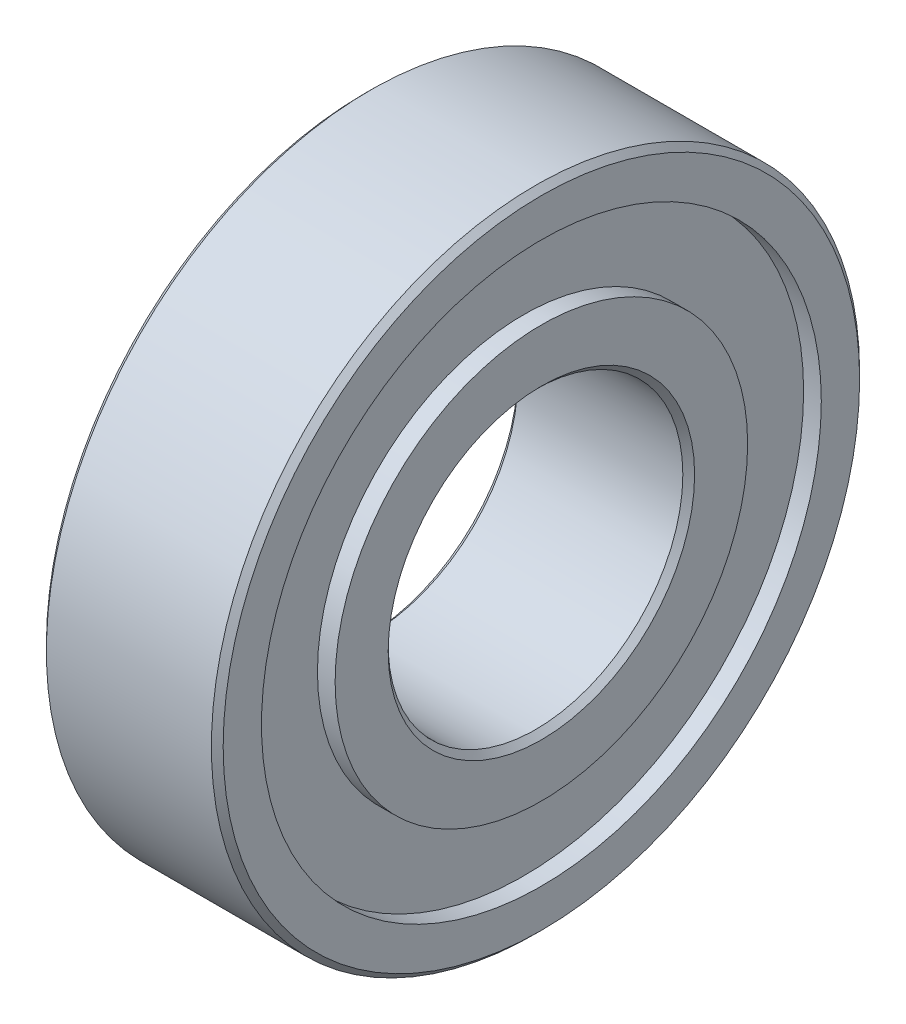
ISO-10303-21;
HEADER;
FILE_DESCRIPTION(('STEP AP214'),'2;1');
FILE_NAME('part.step','',(''),(''),'','','');
FILE_SCHEMA(('AUTOMOTIVE_DESIGN { 1 0 10303 214 1 1 1 1 }'));
ENDSEC;
DATA;
#1=APPLICATION_CONTEXT('core data for automotive mechanical design processes');
#2=APPLICATION_PROTOCOL_DEFINITION('international standard','automotive_design',2000,#1);
#3=PRODUCT_CONTEXT('',#1,'mechanical');
#4=PRODUCT('Part','Part','',(#3));
#5=PRODUCT_RELATED_PRODUCT_CATEGORY('part','',(#4));
#6=PRODUCT_DEFINITION_FORMATION('','',#4);
#7=PRODUCT_DEFINITION_CONTEXT('part definition',#1,'design');
#8=PRODUCT_DEFINITION('design','',#6,#7);
#9=PRODUCT_DEFINITION_SHAPE('','',#8);
#10=(LENGTH_UNIT() NAMED_UNIT(*) SI_UNIT(.MILLI.,.METRE.));
#11=(NAMED_UNIT(*) PLANE_ANGLE_UNIT() SI_UNIT($,.RADIAN.));
#12=(NAMED_UNIT(*) SI_UNIT($,.STERADIAN.) SOLID_ANGLE_UNIT());
#13=UNCERTAINTY_MEASURE_WITH_UNIT(LENGTH_MEASURE(1.E-05),#10,'distance_accuracy_value','');
#14=(GEOMETRIC_REPRESENTATION_CONTEXT(3) GLOBAL_UNCERTAINTY_ASSIGNED_CONTEXT((#13)) GLOBAL_UNIT_ASSIGNED_CONTEXT((#10,
#11,#12)) REPRESENTATION_CONTEXT('',''));
#15=CARTESIAN_POINT('',(0.,0.,0.));
#16=DIRECTION('',(0.,0.,1.));
#17=DIRECTION('',(1.,0.,0.));
#18=AXIS2_PLACEMENT_3D('',#15,#16,#17);
#19=CARTESIAN_POINT('',(0.,0.,0.));
#20=DIRECTION('',(1.,0.,0.));
#21=DIRECTION('',(0.,0.,-1.));
#22=AXIS2_PLACEMENT_3D('',#19,#20,#21);
#23=PLANE('',#22);
#24=CARTESIAN_POINT('',(0.,0.,0.));
#25=DIRECTION('',(1.,0.,0.));
#26=DIRECTION('',(0.,0.,-1.));
#27=AXIS2_PLACEMENT_3D('',#24,#25,#26);
#28=CIRCLE('',#27,5.2);
#29=CARTESIAN_POINT('',(0.,0.,-5.2));
#30=VERTEX_POINT('',#29);
#31=EDGE_CURVE('E10',#30,#30,#28,.T.);
#32=ORIENTED_EDGE('',*,*,#31,.T.);
#33=EDGE_LOOP('',(#32));
#34=FACE_BOUND('',#33,.T.);
#35=CARTESIAN_POINT('',(0.,0.,0.45087681169876));
#36=DIRECTION('',(-1.,0.,0.));
#37=DIRECTION('',(0.,0.,1.));
#38=AXIS2_PLACEMENT_3D('',#35,#36,#37);
#39=CIRCLE('',#38,7.);
#40=CARTESIAN_POINT('',(0.,0.,7.45087681169876));
#41=VERTEX_POINT('',#40);
#42=EDGE_CURVE('E83',#41,#41,#39,.T.);
#43=ORIENTED_EDGE('',*,*,#42,.T.);
#44=EDGE_LOOP('',(#43));
#45=FACE_BOUND('',#44,.T.);
#46=ADVANCED_FACE('F32',(#34,#45),#23,.F.);
#47=CARTESIAN_POINT('',(6.,0.,0.));
#48=DIRECTION('',(1.,0.,0.));
#49=DIRECTION('',(0.,0.,-1.));
#50=AXIS2_PLACEMENT_3D('',#47,#48,#49);
#51=PLANE('',#50);
#52=CARTESIAN_POINT('',(6.,0.,0.));
#53=DIRECTION('',(1.,0.,0.));
#54=DIRECTION('',(0.,0.,-1.));
#55=AXIS2_PLACEMENT_3D('',#52,#53,#54);
#56=CIRCLE('',#55,5.20000000000001);
#57=CARTESIAN_POINT('',(6.,0.,-5.20000000000001));
#58=VERTEX_POINT('',#57);
#59=EDGE_CURVE('E39',#58,#58,#56,.F.);
#60=ORIENTED_EDGE('',*,*,#59,.T.);
#61=EDGE_LOOP('',(#60));
#62=FACE_BOUND('',#61,.T.);
#63=CARTESIAN_POINT('',(6.,0.,0.000375624504543939));
#64=DIRECTION('',(1.,0.,0.));
#65=DIRECTION('',(0.,0.,-1.));
#66=AXIS2_PLACEMENT_3D('',#63,#64,#65);
#67=CIRCLE('',#66,7.);
#68=CARTESIAN_POINT('',(6.,0.,-6.99962437549546));
#69=VERTEX_POINT('',#68);
#70=EDGE_CURVE('E71',#69,#69,#67,.T.);
#71=ORIENTED_EDGE('',*,*,#70,.T.);
#72=EDGE_LOOP('',(#71));
#73=FACE_BOUND('',#72,.T.);
#74=ADVANCED_FACE('F118',(#62,#73),#51,.T.);
#75=CARTESIAN_POINT('',(6.,0.,0.));
#76=DIRECTION('',(1.,0.,0.));
#77=DIRECTION('',(0.,0.,-1.));
#78=AXIS2_PLACEMENT_3D('',#75,#76,#77);
#79=CIRCLE('',#78,10.8);
#80=CARTESIAN_POINT('',(6.,0.,-10.8));
#81=VERTEX_POINT('',#80);
#82=EDGE_CURVE('E61',#81,#81,#79,.T.);
#83=ORIENTED_EDGE('',*,*,#82,.T.);
#84=EDGE_LOOP('',(#83));
#85=FACE_BOUND('',#84,.T.);
#86=CARTESIAN_POINT('',(6.,0.,0.000375624504543939));
#87=DIRECTION('',(1.,0.,0.));
#88=DIRECTION('',(0.,0.,-1.));
#89=AXIS2_PLACEMENT_3D('',#86,#87,#88);
#90=CIRCLE('',#89,9.49962437549546);
#91=CARTESIAN_POINT('',(6.,0.,-9.49924875099091));
#92=VERTEX_POINT('',#91);
#93=EDGE_CURVE('E65',#92,#92,#90,.T.);
#94=ORIENTED_EDGE('',*,*,#93,.F.);
#95=EDGE_LOOP('',(#94));
#96=FACE_BOUND('',#95,.T.);
#97=ADVANCED_FACE('F108',(#85,#96),#51,.T.);
#98=CARTESIAN_POINT('',(0.,0.,0.));
#99=DIRECTION('',(1.,0.,0.));
#100=DIRECTION('',(0.,0.,-1.));
#101=AXIS2_PLACEMENT_3D('',#98,#99,#100);
#102=CIRCLE('',#101,10.8);
#103=CARTESIAN_POINT('',(0.,0.,-10.8));
#104=VERTEX_POINT('',#103);
#105=EDGE_CURVE('E52',#104,#104,#102,.F.);
#106=ORIENTED_EDGE('',*,*,#105,.T.);
#107=EDGE_LOOP('',(#106));
#108=FACE_BOUND('',#107,.T.);
#109=CARTESIAN_POINT('',(0.,0.,0.45087681169876));
#110=DIRECTION('',(-1.,0.,0.));
#111=DIRECTION('',(0.,0.,1.));
#112=AXIS2_PLACEMENT_3D('',#109,#110,#111);
#113=CIRCLE('',#112,9.95087681169876);
#114=CARTESIAN_POINT('',(0.,0.,10.4017536233975));
#115=VERTEX_POINT('',#114);
#116=EDGE_CURVE('E77',#115,#115,#113,.T.);
#117=ORIENTED_EDGE('',*,*,#116,.F.);
#118=EDGE_LOOP('',(#117));
#119=FACE_BOUND('',#118,.T.);
#120=ADVANCED_FACE('F105',(#108,#119),#23,.F.);
#121=CARTESIAN_POINT('',(6.,0.,0.));
#122=DIRECTION('',(-1.,0.,0.));
#123=DIRECTION('',(0.,0.,1.));
#124=AXIS2_PLACEMENT_3D('',#121,#122,#123);
#125=CYLINDRICAL_SURFACE('',#124,11.);
#126=CARTESIAN_POINT('',(5.8,0.,0.));
#127=DIRECTION('',(1.,0.,0.));
#128=DIRECTION('',(0.,0.,-1.));
#129=AXIS2_PLACEMENT_3D('',#126,#127,#128);
#130=CIRCLE('',#129,11.);
#131=CARTESIAN_POINT('',(5.8,0.,-11.));
#132=VERTEX_POINT('',#131);
#133=EDGE_CURVE('E55',#132,#132,#130,.F.);
#134=ORIENTED_EDGE('',*,*,#133,.T.);
#135=EDGE_LOOP('',(#134));
#136=FACE_BOUND('',#135,.T.);
#137=CARTESIAN_POINT('',(0.199999999999995,0.,0.));
#138=DIRECTION('',(1.,0.,0.));
#139=DIRECTION('',(0.,0.,-1.));
#140=AXIS2_PLACEMENT_3D('',#137,#138,#139);
#141=CIRCLE('',#140,11.);
#142=CARTESIAN_POINT('',(0.199999999999995,0.,-11.));
#143=VERTEX_POINT('',#142);
#144=EDGE_CURVE('E58',#143,#143,#141,.T.);
#145=ORIENTED_EDGE('',*,*,#144,.T.);
#146=EDGE_LOOP('',(#145));
#147=FACE_BOUND('',#146,.T.);
#148=ADVANCED_FACE('F107',(#136,#147),#125,.T.);
#149=CARTESIAN_POINT('',(6.,0.,0.));
#150=DIRECTION('',(-1.,0.,0.));
#151=DIRECTION('',(0.,0.,1.));
#152=AXIS2_PLACEMENT_3D('',#149,#150,#151);
#153=CYLINDRICAL_SURFACE('',#152,5.);
#154=CARTESIAN_POINT('',(5.8,0.,0.));
#155=DIRECTION('',(1.,0.,0.));
#156=DIRECTION('',(0.,0.,-1.));
#157=AXIS2_PLACEMENT_3D('',#154,#155,#156);
#158=CIRCLE('',#157,5.);
#159=CARTESIAN_POINT('',(5.8,0.,-5.));
#160=VERTEX_POINT('',#159);
#161=EDGE_CURVE('E43',#160,#160,#158,.T.);
#162=ORIENTED_EDGE('',*,*,#161,.T.);
#163=EDGE_LOOP('',(#162));
#164=FACE_BOUND('',#163,.T.);
#165=CARTESIAN_POINT('',(0.199999999999994,0.,0.));
#166=DIRECTION('',(1.,0.,0.));
#167=DIRECTION('',(0.,0.,-1.));
#168=AXIS2_PLACEMENT_3D('',#165,#166,#167);
#169=CIRCLE('',#168,5.);
#170=CARTESIAN_POINT('',(0.199999999999994,0.,-5.));
#171=VERTEX_POINT('',#170);
#172=EDGE_CURVE('E47',#171,#171,#169,.F.);
#173=ORIENTED_EDGE('',*,*,#172,.T.);
#174=EDGE_LOOP('',(#173));
#175=FACE_BOUND('',#174,.T.);
#176=ADVANCED_FACE('F115',(#164,#175),#153,.F.);
#177=CARTESIAN_POINT('',(5.4,0.,0.000375624504543939));
#178=DIRECTION('',(1.,0.,0.));
#179=DIRECTION('',(0.,0.,-1.));
#180=AXIS2_PLACEMENT_3D('',#177,#178,#179);
#181=CYLINDRICAL_SURFACE('',#180,9.49962437549546);
#182=CARTESIAN_POINT('',(5.4,0.,0.000375624504543939));
#183=DIRECTION('',(1.,0.,0.));
#184=DIRECTION('',(0.,0.,-1.));
#185=AXIS2_PLACEMENT_3D('',#182,#183,#184);
#186=CIRCLE('',#185,9.49962437549546);
#187=CARTESIAN_POINT('',(5.4,0.,-9.49924875099091));
#188=VERTEX_POINT('',#187);
#189=EDGE_CURVE('E64',#188,#188,#186,.T.);
#190=ORIENTED_EDGE('',*,*,#189,.F.);
#191=EDGE_LOOP('',(#190));
#192=FACE_BOUND('',#191,.T.);
#193=ORIENTED_EDGE('',*,*,#93,.T.);
#194=EDGE_LOOP('',(#193));
#195=FACE_BOUND('',#194,.T.);
#196=ADVANCED_FACE('F143',(#192,#195),#181,.F.);
#197=CARTESIAN_POINT('',(5.4,0.,0.000375624504543939));
#198=DIRECTION('',(1.,0.,0.));
#199=DIRECTION('',(0.,0.,-1.));
#200=AXIS2_PLACEMENT_3D('',#197,#198,#199);
#201=PLANE('',#200);
#202=CARTESIAN_POINT('',(5.4,0.,0.000375624504543939));
#203=DIRECTION('',(1.,0.,0.));
#204=DIRECTION('',(0.,0.,-1.));
#205=AXIS2_PLACEMENT_3D('',#202,#203,#204);
#206=CIRCLE('',#205,7.);
#207=CARTESIAN_POINT('',(5.4,0.,-6.99962437549546));
#208=VERTEX_POINT('',#207);
#209=EDGE_CURVE('E68',#208,#208,#206,.T.);
#210=ORIENTED_EDGE('',*,*,#209,.F.);
#211=EDGE_LOOP('',(#210));
#212=FACE_BOUND('',#211,.T.);
#213=ORIENTED_EDGE('',*,*,#189,.T.);
#214=EDGE_LOOP('',(#213));
#215=FACE_BOUND('',#214,.T.);
#216=ADVANCED_FACE('F139',(#212,#215),#201,.T.);
#217=CARTESIAN_POINT('',(5.4,0.,0.000375624504543939));
#218=DIRECTION('',(1.,0.,0.));
#219=DIRECTION('',(0.,0.,-1.));
#220=AXIS2_PLACEMENT_3D('',#217,#218,#219);
#221=CYLINDRICAL_SURFACE('',#220,7.);
#222=ORIENTED_EDGE('',*,*,#209,.T.);
#223=EDGE_LOOP('',(#222));
#224=FACE_BOUND('',#223,.T.);
#225=ORIENTED_EDGE('',*,*,#70,.F.);
#226=EDGE_LOOP('',(#225));
#227=FACE_BOUND('',#226,.T.);
#228=ADVANCED_FACE('F101',(#224,#227),#221,.T.);
#229=CARTESIAN_POINT('',(0.6,0.,0.45087681169876));
#230=DIRECTION('',(-1.,0.,0.));
#231=DIRECTION('',(0.,0.,1.));
#232=AXIS2_PLACEMENT_3D('',#229,#230,#231);
#233=CYLINDRICAL_SURFACE('',#232,9.95087681169876);
#234=CARTESIAN_POINT('',(0.6,0.,0.45087681169876));
#235=DIRECTION('',(-1.,0.,0.));
#236=DIRECTION('',(0.,0.,1.));
#237=AXIS2_PLACEMENT_3D('',#234,#235,#236);
#238=CIRCLE('',#237,9.95087681169876);
#239=CARTESIAN_POINT('',(0.6,0.,10.4017536233975));
#240=VERTEX_POINT('',#239);
#241=EDGE_CURVE('E74',#240,#240,#238,.T.);
#242=ORIENTED_EDGE('',*,*,#241,.F.);
#243=EDGE_LOOP('',(#242));
#244=FACE_BOUND('',#243,.T.);
#245=ORIENTED_EDGE('',*,*,#116,.T.);
#246=EDGE_LOOP('',(#245));
#247=FACE_BOUND('',#246,.T.);
#248=ADVANCED_FACE('F95',(#244,#247),#233,.F.);
#249=CARTESIAN_POINT('',(0.6,0.,0.45087681169876));
#250=DIRECTION('',(-1.,0.,0.));
#251=DIRECTION('',(0.,0.,1.));
#252=AXIS2_PLACEMENT_3D('',#249,#250,#251);
#253=PLANE('',#252);
#254=CARTESIAN_POINT('',(0.6,0.,0.45087681169876));
#255=DIRECTION('',(-1.,0.,0.));
#256=DIRECTION('',(0.,0.,1.));
#257=AXIS2_PLACEMENT_3D('',#254,#255,#256);
#258=CIRCLE('',#257,7.);
#259=CARTESIAN_POINT('',(0.6,0.,7.45087681169876));
#260=VERTEX_POINT('',#259);
#261=EDGE_CURVE('E80',#260,#260,#258,.T.);
#262=ORIENTED_EDGE('',*,*,#261,.F.);
#263=EDGE_LOOP('',(#262));
#264=FACE_BOUND('',#263,.T.);
#265=ORIENTED_EDGE('',*,*,#241,.T.);
#266=EDGE_LOOP('',(#265));
#267=FACE_BOUND('',#266,.T.);
#268=ADVANCED_FACE('F92',(#264,#267),#253,.T.);
#269=CARTESIAN_POINT('',(0.6,0.,0.45087681169876));
#270=DIRECTION('',(-1.,0.,0.));
#271=DIRECTION('',(0.,0.,1.));
#272=AXIS2_PLACEMENT_3D('',#269,#270,#271);
#273=CYLINDRICAL_SURFACE('',#272,7.);
#274=ORIENTED_EDGE('',*,*,#261,.T.);
#275=EDGE_LOOP('',(#274));
#276=FACE_BOUND('',#275,.T.);
#277=ORIENTED_EDGE('',*,*,#42,.F.);
#278=EDGE_LOOP('',(#277));
#279=FACE_BOUND('',#278,.T.);
#280=ADVANCED_FACE('F89',(#276,#279),#273,.T.);
#281=CARTESIAN_POINT('',(6.,0.,0.));
#282=DIRECTION('',(-1.,0.,0.));
#283=DIRECTION('',(0.,0.,1.));
#284=AXIS2_PLACEMENT_3D('',#281,#282,#283);
#285=CONICAL_SURFACE('',#284,10.8,0.785398163397461);
#286=ORIENTED_EDGE('',*,*,#133,.F.);
#287=EDGE_LOOP('',(#286));
#288=FACE_BOUND('',#287,.T.);
#289=ORIENTED_EDGE('',*,*,#82,.F.);
#290=EDGE_LOOP('',(#289));
#291=FACE_BOUND('',#290,.T.);
#292=ADVANCED_FACE('F128',(#288,#291),#285,.T.);
#293=CARTESIAN_POINT('',(0.199999999999995,0.,0.));
#294=DIRECTION('',(1.,0.,0.));
#295=DIRECTION('',(0.,0.,-1.));
#296=AXIS2_PLACEMENT_3D('',#293,#294,#295);
#297=CONICAL_SURFACE('',#296,11.,0.785398163397453);
#298=ORIENTED_EDGE('',*,*,#105,.F.);
#299=EDGE_LOOP('',(#298));
#300=FACE_BOUND('',#299,.T.);
#301=ORIENTED_EDGE('',*,*,#144,.F.);
#302=EDGE_LOOP('',(#301));
#303=FACE_BOUND('',#302,.T.);
#304=ADVANCED_FACE('F133',(#300,#303),#297,.T.);
#305=CARTESIAN_POINT('',(5.8,0.,0.));
#306=DIRECTION('',(1.,0.,0.));
#307=DIRECTION('',(0.,0.,-1.));
#308=AXIS2_PLACEMENT_3D('',#305,#306,#307);
#309=CONICAL_SURFACE('',#308,5.,0.785398163397453);
#310=ORIENTED_EDGE('',*,*,#59,.F.);
#311=EDGE_LOOP('',(#310));
#312=FACE_BOUND('',#311,.T.);
#313=ORIENTED_EDGE('',*,*,#161,.F.);
#314=EDGE_LOOP('',(#313));
#315=FACE_BOUND('',#314,.T.);
#316=ADVANCED_FACE('F158',(#312,#315),#309,.F.);
#317=CARTESIAN_POINT('',(0.,0.,0.));
#318=DIRECTION('',(-1.,0.,0.));
#319=DIRECTION('',(0.,0.,1.));
#320=AXIS2_PLACEMENT_3D('',#317,#318,#319);
#321=CONICAL_SURFACE('',#320,5.2,0.785398163397453);
#322=ORIENTED_EDGE('',*,*,#172,.F.);
#323=EDGE_LOOP('',(#322));
#324=FACE_BOUND('',#323,.T.);
#325=ORIENTED_EDGE('',*,*,#31,.F.);
#326=EDGE_LOOP('',(#325));
#327=FACE_BOUND('',#326,.T.);
#328=ADVANCED_FACE('F34',(#324,#327),#321,.F.);
#329=CLOSED_SHELL('',(#46,#74,#97,#120,#148,#176,#196,#216,#228,#248,#268,#280,#292,#304,#316,#328));
#330=MANIFOLD_SOLID_BREP('B2',#329);
#331=ADVANCED_BREP_SHAPE_REPRESENTATION('',(#18,#330),#14);
#332=SHAPE_DEFINITION_REPRESENTATION(#9,#331);
ENDSEC;
END-ISO-10303-21;
